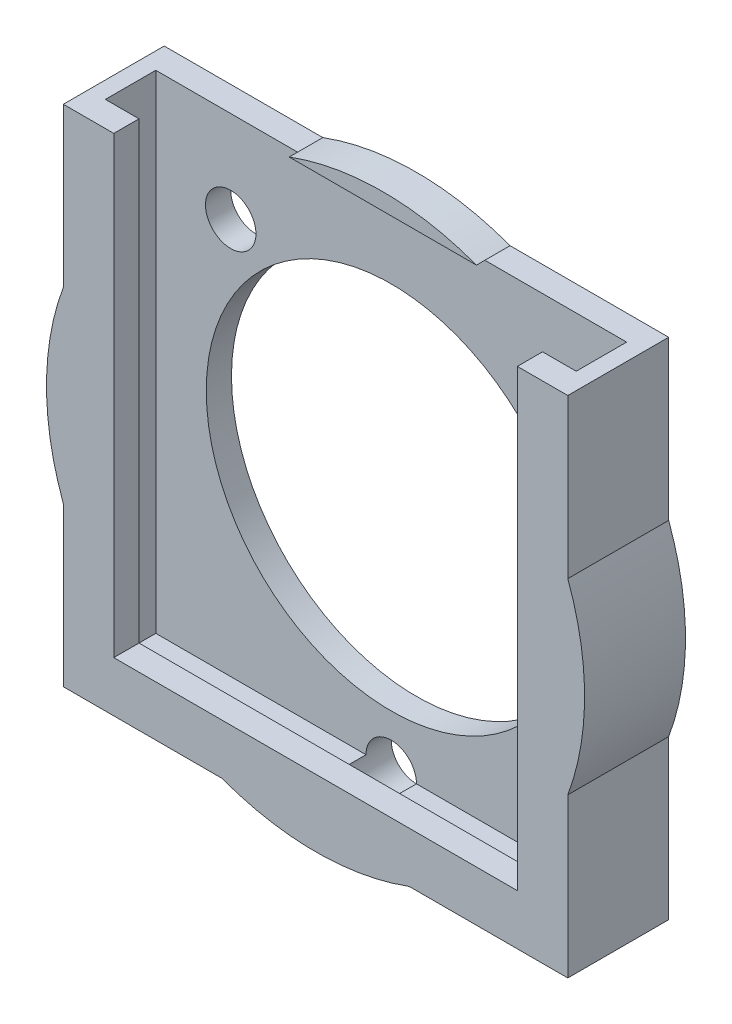
ISO-10303-21;
HEADER;
FILE_DESCRIPTION(('STEP AP214'),'2;1');
FILE_NAME('part.step','',(''),(''),'','','');
FILE_SCHEMA(('AUTOMOTIVE_DESIGN { 1 0 10303 214 1 1 1 1 }'));
ENDSEC;
DATA;
#1=APPLICATION_CONTEXT('core data for automotive mechanical design processes');
#2=APPLICATION_PROTOCOL_DEFINITION('international standard','automotive_design',2000,#1);
#3=PRODUCT_CONTEXT('',#1,'mechanical');
#4=PRODUCT('Part','Part','',(#3));
#5=PRODUCT_RELATED_PRODUCT_CATEGORY('part','',(#4));
#6=PRODUCT_DEFINITION_FORMATION('','',#4);
#7=PRODUCT_DEFINITION_CONTEXT('part definition',#1,'design');
#8=PRODUCT_DEFINITION('design','',#6,#7);
#9=PRODUCT_DEFINITION_SHAPE('','',#8);
#10=(LENGTH_UNIT() NAMED_UNIT(*) SI_UNIT(.MILLI.,.METRE.));
#11=(NAMED_UNIT(*) PLANE_ANGLE_UNIT() SI_UNIT($,.RADIAN.));
#12=(NAMED_UNIT(*) SI_UNIT($,.STERADIAN.) SOLID_ANGLE_UNIT());
#13=UNCERTAINTY_MEASURE_WITH_UNIT(LENGTH_MEASURE(1.E-05),#10,'distance_accuracy_value','');
#14=(GEOMETRIC_REPRESENTATION_CONTEXT(3) GLOBAL_UNCERTAINTY_ASSIGNED_CONTEXT((#13)) GLOBAL_UNIT_ASSIGNED_CONTEXT((#10,
#11,#12)) REPRESENTATION_CONTEXT('',''));
#15=CARTESIAN_POINT('',(0.,0.,0.));
#16=DIRECTION('',(0.,0.,1.));
#17=DIRECTION('',(1.,0.,0.));
#18=AXIS2_PLACEMENT_3D('',#15,#16,#17);
#19=CARTESIAN_POINT('',(0.,15.,6.));
#20=DIRECTION('',(0.,1.,0.));
#21=DIRECTION('',(-1.,0.,0.));
#22=AXIS2_PLACEMENT_3D('',#19,#20,#21);
#23=PLANE('',#22);
#24=DIRECTION('',(0.,0.,-1.));
#25=VECTOR('',#24,1.);
#26=CARTESIAN_POINT('',(5.56776436283004,15.,6.));
#27=LINE('',#26,#25);
#28=CARTESIAN_POINT('',(5.56776436283004,15.,1.5));
#29=VERTEX_POINT('',#28);
#30=CARTESIAN_POINT('',(5.56776436283004,15.,0.));
#31=VERTEX_POINT('',#30);
#32=EDGE_CURVE('E421',#29,#31,#27,.T.);
#33=ORIENTED_EDGE('',*,*,#32,.F.);
#34=DIRECTION('',(1.,0.,0.));
#35=VECTOR('',#34,1.);
#36=CARTESIAN_POINT('',(0.,15.,1.5));
#37=LINE('',#36,#35);
#38=CARTESIAN_POINT('',(14.,15.,1.5));
#39=VERTEX_POINT('',#38);
#40=EDGE_CURVE('E309',#29,#39,#37,.T.);
#41=ORIENTED_EDGE('',*,*,#40,.T.);
#42=DIRECTION('',(0.,0.,-1.));
#43=VECTOR('',#42,1.);
#44=CARTESIAN_POINT('',(14.,15.,4.));
#45=LINE('',#44,#43);
#46=CARTESIAN_POINT('',(14.,15.,4.5));
#47=VERTEX_POINT('',#46);
#48=EDGE_CURVE('E335',#47,#39,#45,.T.);
#49=ORIENTED_EDGE('',*,*,#48,.F.);
#50=DIRECTION('',(1.,0.,0.));
#51=VECTOR('',#50,1.);
#52=CARTESIAN_POINT('',(0.,15.,4.5));
#53=LINE('',#52,#51);
#54=CARTESIAN_POINT('',(12.,15.,4.5));
#55=VERTEX_POINT('',#54);
#56=EDGE_CURVE('E310',#55,#47,#53,.T.);
#57=ORIENTED_EDGE('',*,*,#56,.F.);
#58=DIRECTION('',(0.,0.,1.));
#59=VECTOR('',#58,1.);
#60=CARTESIAN_POINT('',(12.,15.,2.));
#61=LINE('',#60,#59);
#62=CARTESIAN_POINT('',(12.,15.,6.));
#63=VERTEX_POINT('',#62);
#64=EDGE_CURVE('E344',#55,#63,#61,.T.);
#65=ORIENTED_EDGE('',*,*,#64,.T.);
#66=DIRECTION('',(1.,0.,0.));
#67=VECTOR('',#66,1.);
#68=CARTESIAN_POINT('',(0.,15.,6.));
#69=LINE('',#68,#67);
#70=CARTESIAN_POINT('',(15.,15.,6.));
#71=VERTEX_POINT('',#70);
#72=EDGE_CURVE('E379',#63,#71,#69,.T.);
#73=ORIENTED_EDGE('',*,*,#72,.T.);
#74=DIRECTION('',(0.,0.,-1.));
#75=VECTOR('',#74,1.);
#76=CARTESIAN_POINT('',(15.,15.,6.));
#77=LINE('',#76,#75);
#78=CARTESIAN_POINT('',(15.,15.,0.));
#79=VERTEX_POINT('',#78);
#80=EDGE_CURVE('E423',#71,#79,#77,.T.);
#81=ORIENTED_EDGE('',*,*,#80,.T.);
#82=DIRECTION('',(1.,0.,0.));
#83=VECTOR('',#82,1.);
#84=CARTESIAN_POINT('',(0.,15.,0.));
#85=LINE('',#84,#83);
#86=EDGE_CURVE('E403',#31,#79,#85,.T.);
#87=ORIENTED_EDGE('',*,*,#86,.F.);
#88=EDGE_LOOP('',(#33,#41,#49,#57,#65,#73,#81,#87));
#89=FACE_BOUND('',#88,.T.);
#90=ADVANCED_FACE('F119',(#89),#23,.T.);
#91=CARTESIAN_POINT('',(0.,15.,6.));
#92=DIRECTION('',(0.,1.,0.));
#93=DIRECTION('',(-1.,0.,0.));
#94=AXIS2_PLACEMENT_3D('',#91,#92,#93);
#95=PLANE('',#94);
#96=DIRECTION('',(0.,0.,1.));
#97=VECTOR('',#96,1.);
#98=CARTESIAN_POINT('',(-14.,15.,2.));
#99=LINE('',#98,#97);
#100=CARTESIAN_POINT('',(-14.,15.,1.5));
#101=VERTEX_POINT('',#100);
#102=CARTESIAN_POINT('',(-14.,15.,4.5));
#103=VERTEX_POINT('',#102);
#104=EDGE_CURVE('E338',#101,#103,#99,.T.);
#105=ORIENTED_EDGE('',*,*,#104,.F.);
#106=CARTESIAN_POINT('',(-5.56776436283004,15.,1.5));
#107=VERTEX_POINT('',#106);
#108=EDGE_CURVE('E303',#101,#107,#37,.T.);
#109=ORIENTED_EDGE('',*,*,#108,.T.);
#110=DIRECTION('',(0.,0.,-1.));
#111=VECTOR('',#110,1.);
#112=CARTESIAN_POINT('',(-5.56776436283004,15.,6.));
#113=LINE('',#112,#111);
#114=CARTESIAN_POINT('',(-5.56776436283004,15.,0.));
#115=VERTEX_POINT('',#114);
#116=EDGE_CURVE('E418',#107,#115,#113,.T.);
#117=ORIENTED_EDGE('',*,*,#116,.T.);
#118=DIRECTION('',(1.,0.,0.));
#119=VECTOR('',#118,1.);
#120=CARTESIAN_POINT('',(0.,15.,0.));
#121=LINE('',#120,#119);
#122=CARTESIAN_POINT('',(-15.,15.,0.));
#123=VERTEX_POINT('',#122);
#124=EDGE_CURVE('E409',#123,#115,#121,.T.);
#125=ORIENTED_EDGE('',*,*,#124,.F.);
#126=DIRECTION('',(0.,0.,-1.));
#127=VECTOR('',#126,1.);
#128=CARTESIAN_POINT('',(-15.,15.,6.));
#129=LINE('',#128,#127);
#130=CARTESIAN_POINT('',(-15.,15.,6.));
#131=VERTEX_POINT('',#130);
#132=EDGE_CURVE('E416',#131,#123,#129,.T.);
#133=ORIENTED_EDGE('',*,*,#132,.F.);
#134=DIRECTION('',(1.,0.,0.));
#135=VECTOR('',#134,1.);
#136=CARTESIAN_POINT('',(0.,15.,6.));
#137=LINE('',#136,#135);
#138=CARTESIAN_POINT('',(-12.,15.,6.));
#139=VERTEX_POINT('',#138);
#140=EDGE_CURVE('E381',#131,#139,#137,.T.);
#141=ORIENTED_EDGE('',*,*,#140,.T.);
#142=DIRECTION('',(0.,0.,1.));
#143=VECTOR('',#142,1.);
#144=CARTESIAN_POINT('',(-12.,15.,2.));
#145=LINE('',#144,#143);
#146=CARTESIAN_POINT('',(-12.,15.,4.5));
#147=VERTEX_POINT('',#146);
#148=EDGE_CURVE('E358',#147,#139,#145,.T.);
#149=ORIENTED_EDGE('',*,*,#148,.F.);
#150=EDGE_CURVE('E307',#103,#147,#53,.T.);
#151=ORIENTED_EDGE('',*,*,#150,.F.);
#152=EDGE_LOOP('',(#105,#109,#117,#125,#133,#141,#149,#151));
#153=FACE_BOUND('',#152,.T.);
#154=ADVANCED_FACE('F476',(#153),#95,.T.);
#155=CARTESIAN_POINT('',(0.,0.,-4.));
#156=DIRECTION('',(0.,0.,1.));
#157=DIRECTION('',(1.,0.,0.));
#158=AXIS2_PLACEMENT_3D('',#155,#156,#157);
#159=CYLINDRICAL_SURFACE('',#158,11.);
#160=CARTESIAN_POINT('',(0.,0.,0.));
#161=DIRECTION('',(0.,0.,1.));
#162=DIRECTION('',(1.,0.,0.));
#163=AXIS2_PLACEMENT_3D('',#160,#161,#162);
#164=CIRCLE('',#163,11.);
#165=CARTESIAN_POINT('',(11.,0.,0.));
#166=VERTEX_POINT('',#165);
#167=EDGE_CURVE('E355',#166,#166,#164,.T.);
#168=ORIENTED_EDGE('',*,*,#167,.F.);
#169=EDGE_LOOP('',(#168));
#170=FACE_BOUND('',#169,.T.);
#171=CARTESIAN_POINT('',(0.,0.,1.5));
#172=DIRECTION('',(0.,0.,1.));
#173=DIRECTION('',(1.,0.,0.));
#174=AXIS2_PLACEMENT_3D('',#171,#172,#173);
#175=CIRCLE('',#174,11.);
#176=CARTESIAN_POINT('',(11.,0.,1.5));
#177=VERTEX_POINT('',#176);
#178=EDGE_CURVE('E331',#177,#177,#175,.F.);
#179=ORIENTED_EDGE('',*,*,#178,.F.);
#180=EDGE_LOOP('',(#179));
#181=FACE_BOUND('',#180,.T.);
#182=ADVANCED_FACE('F571',(#170,#181),#159,.F.);
#183=CARTESIAN_POINT('',(0.,0.,6.));
#184=DIRECTION('',(0.,0.,1.));
#185=DIRECTION('',(1.,0.,0.));
#186=AXIS2_PLACEMENT_3D('',#183,#184,#185);
#187=PLANE('',#186);
#188=ORIENTED_EDGE('',*,*,#72,.F.);
#189=DIRECTION('',(0.,-1.,0.));
#190=VECTOR('',#189,1.);
#191=CARTESIAN_POINT('',(12.,0.,6.));
#192=LINE('',#191,#190);
#193=CARTESIAN_POINT('',(12.,-12.,6.));
#194=VERTEX_POINT('',#193);
#195=EDGE_CURVE('E337',#63,#194,#192,.T.);
#196=ORIENTED_EDGE('',*,*,#195,.T.);
#197=DIRECTION('',(-1.,0.,0.));
#198=VECTOR('',#197,1.);
#199=CARTESIAN_POINT('',(0.,-12.,6.));
#200=LINE('',#199,#198);
#201=CARTESIAN_POINT('',(-12.,-12.,6.));
#202=VERTEX_POINT('',#201);
#203=EDGE_CURVE('E345',#194,#202,#200,.T.);
#204=ORIENTED_EDGE('',*,*,#203,.T.);
#205=DIRECTION('',(0.,1.,0.));
#206=VECTOR('',#205,1.);
#207=CARTESIAN_POINT('',(-12.,0.,6.));
#208=LINE('',#207,#206);
#209=EDGE_CURVE('E348',#202,#139,#208,.T.);
#210=ORIENTED_EDGE('',*,*,#209,.T.);
#211=ORIENTED_EDGE('',*,*,#140,.F.);
#212=DIRECTION('',(0.,1.,0.));
#213=VECTOR('',#212,1.);
#214=CARTESIAN_POINT('',(-15.,0.,6.));
#215=LINE('',#214,#213);
#216=CARTESIAN_POINT('',(-15.,5.56776436283003,6.));
#217=VERTEX_POINT('',#216);
#218=EDGE_CURVE('E384',#217,#131,#215,.T.);
#219=ORIENTED_EDGE('',*,*,#218,.F.);
#220=CARTESIAN_POINT('',(0.,0.,6.));
#221=DIRECTION('',(0.,0.,1.));
#222=DIRECTION('',(1.,0.,0.));
#223=AXIS2_PLACEMENT_3D('',#220,#221,#222);
#224=CIRCLE('',#223,16.);
#225=CARTESIAN_POINT('',(-15.,-5.56776436283004,6.));
#226=VERTEX_POINT('',#225);
#227=EDGE_CURVE('E364',#217,#226,#224,.T.);
#228=ORIENTED_EDGE('',*,*,#227,.T.);
#229=DIRECTION('',(0.,1.,0.));
#230=VECTOR('',#229,1.);
#231=CARTESIAN_POINT('',(-15.,-15.,6.));
#232=LINE('',#231,#230);
#233=CARTESIAN_POINT('',(-15.,-15.,6.));
#234=VERTEX_POINT('',#233);
#235=EDGE_CURVE('E438',#234,#226,#232,.T.);
#236=ORIENTED_EDGE('',*,*,#235,.F.);
#237=DIRECTION('',(1.,0.,0.));
#238=VECTOR('',#237,1.);
#239=CARTESIAN_POINT('',(-15.,-15.,6.));
#240=LINE('',#239,#238);
#241=CARTESIAN_POINT('',(-5.56776436283,-15.,6.));
#242=VERTEX_POINT('',#241);
#243=EDGE_CURVE('E435',#234,#242,#240,.T.);
#244=ORIENTED_EDGE('',*,*,#243,.T.);
#245=CARTESIAN_POINT('',(5.56776436283,-15.,6.));
#246=VERTEX_POINT('',#245);
#247=EDGE_CURVE('E368',#242,#246,#224,.T.);
#248=ORIENTED_EDGE('',*,*,#247,.T.);
#249=DIRECTION('',(1.,0.,0.));
#250=VECTOR('',#249,1.);
#251=CARTESIAN_POINT('',(0.,-15.,6.));
#252=LINE('',#251,#250);
#253=CARTESIAN_POINT('',(15.,-15.,6.));
#254=VERTEX_POINT('',#253);
#255=EDGE_CURVE('E367',#246,#254,#252,.T.);
#256=ORIENTED_EDGE('',*,*,#255,.T.);
#257=DIRECTION('',(0.,1.,0.));
#258=VECTOR('',#257,1.);
#259=CARTESIAN_POINT('',(15.,0.,6.));
#260=LINE('',#259,#258);
#261=CARTESIAN_POINT('',(15.,-5.56776436283002,6.));
#262=VERTEX_POINT('',#261);
#263=EDGE_CURVE('E370',#254,#262,#260,.T.);
#264=ORIENTED_EDGE('',*,*,#263,.T.);
#265=CARTESIAN_POINT('',(0.,0.,6.));
#266=DIRECTION('',(0.,0.,1.));
#267=DIRECTION('',(1.,0.,0.));
#268=AXIS2_PLACEMENT_3D('',#265,#266,#267);
#269=CIRCLE('',#268,16.);
#270=CARTESIAN_POINT('',(15.,5.56776436283001,6.));
#271=VERTEX_POINT('',#270);
#272=EDGE_CURVE('E373',#262,#271,#269,.T.);
#273=ORIENTED_EDGE('',*,*,#272,.T.);
#274=DIRECTION('',(0.,1.,0.));
#275=VECTOR('',#274,1.);
#276=CARTESIAN_POINT('',(15.,0.,6.));
#277=LINE('',#276,#275);
#278=EDGE_CURVE('E376',#271,#71,#277,.T.);
#279=ORIENTED_EDGE('',*,*,#278,.T.);
#280=EDGE_LOOP('',(#188,#196,#204,#210,#211,#219,#228,#236,#244,#248,#256,#264,#273,#279));
#281=FACE_BOUND('',#280,.T.);
#282=ADVANCED_FACE('F485',(#281),#187,.T.);
#283=CARTESIAN_POINT('',(0.,0.,6.));
#284=DIRECTION('',(0.,0.,-1.));
#285=DIRECTION('',(-1.,0.,0.));
#286=AXIS2_PLACEMENT_3D('',#283,#284,#285);
#287=CYLINDRICAL_SURFACE('',#286,16.);
#288=CARTESIAN_POINT('',(0.,0.,2.));
#289=DIRECTION('',(0.,0.,1.));
#290=DIRECTION('',(1.,0.,0.));
#291=AXIS2_PLACEMENT_3D('',#288,#289,#290);
#292=CIRCLE('',#291,16.);
#293=CARTESIAN_POINT('',(5.56776436283004,15.,2.));
#294=VERTEX_POINT('',#293);
#295=CARTESIAN_POINT('',(-5.56776436283004,15.,2.));
#296=VERTEX_POINT('',#295);
#297=EDGE_CURVE('E341',#294,#296,#292,.T.);
#298=ORIENTED_EDGE('',*,*,#297,.F.);
#299=EDGE_CURVE('E142',#294,#29,#27,.T.);
#300=ORIENTED_EDGE('',*,*,#299,.T.);
#301=ORIENTED_EDGE('',*,*,#32,.T.);
#302=CARTESIAN_POINT('',(0.,0.,0.));
#303=DIRECTION('',(0.,0.,1.));
#304=DIRECTION('',(1.,0.,0.));
#305=AXIS2_PLACEMENT_3D('',#302,#303,#304);
#306=CIRCLE('',#305,16.);
#307=EDGE_CURVE('E406',#31,#115,#306,.T.);
#308=ORIENTED_EDGE('',*,*,#307,.T.);
#309=ORIENTED_EDGE('',*,*,#116,.F.);
#310=EDGE_CURVE('E419',#296,#107,#113,.T.);
#311=ORIENTED_EDGE('',*,*,#310,.F.);
#312=EDGE_LOOP('',(#298,#300,#301,#308,#309,#311));
#313=FACE_BOUND('',#312,.T.);
#314=ADVANCED_FACE('F511',(#313),#287,.T.);
#315=CARTESIAN_POINT('',(0.,-15.,6.));
#316=DIRECTION('',(0.,1.,0.));
#317=DIRECTION('',(-1.,0.,0.));
#318=AXIS2_PLACEMENT_3D('',#315,#316,#317);
#319=PLANE('',#318);
#320=DIRECTION('',(1.,0.,0.));
#321=VECTOR('',#320,1.);
#322=CARTESIAN_POINT('',(0.,-15.,0.));
#323=LINE('',#322,#321);
#324=CARTESIAN_POINT('',(5.56776436283,-15.,0.));
#325=VERTEX_POINT('',#324);
#326=CARTESIAN_POINT('',(15.,-15.,0.));
#327=VERTEX_POINT('',#326);
#328=EDGE_CURVE('E391',#325,#327,#323,.T.);
#329=ORIENTED_EDGE('',*,*,#328,.T.);
#330=DIRECTION('',(0.,0.,-1.));
#331=VECTOR('',#330,1.);
#332=CARTESIAN_POINT('',(15.,-15.,6.));
#333=LINE('',#332,#331);
#334=EDGE_CURVE('E429',#254,#327,#333,.T.);
#335=ORIENTED_EDGE('',*,*,#334,.F.);
#336=ORIENTED_EDGE('',*,*,#255,.F.);
#337=DIRECTION('',(0.,0.,-1.));
#338=VECTOR('',#337,1.);
#339=CARTESIAN_POINT('',(5.56776436283,-15.,6.));
#340=LINE('',#339,#338);
#341=EDGE_CURVE('E432',#246,#325,#340,.T.);
#342=ORIENTED_EDGE('',*,*,#341,.T.);
#343=EDGE_LOOP('',(#329,#335,#336,#342));
#344=FACE_BOUND('',#343,.T.);
#345=ADVANCED_FACE('F545',(#344),#319,.F.);
#346=CARTESIAN_POINT('',(15.,0.,6.));
#347=DIRECTION('',(-1.,0.,0.));
#348=DIRECTION('',(0.,-1.,0.));
#349=AXIS2_PLACEMENT_3D('',#346,#347,#348);
#350=PLANE('',#349);
#351=DIRECTION('',(0.,1.,0.));
#352=VECTOR('',#351,1.);
#353=CARTESIAN_POINT('',(15.,0.,0.));
#354=LINE('',#353,#352);
#355=CARTESIAN_POINT('',(15.,5.56776436283001,0.));
#356=VERTEX_POINT('',#355);
#357=EDGE_CURVE('E400',#356,#79,#354,.T.);
#358=ORIENTED_EDGE('',*,*,#357,.T.);
#359=ORIENTED_EDGE('',*,*,#80,.F.);
#360=ORIENTED_EDGE('',*,*,#278,.F.);
#361=DIRECTION('',(0.,0.,-1.));
#362=VECTOR('',#361,1.);
#363=CARTESIAN_POINT('',(15.,5.56776436283001,6.));
#364=LINE('',#363,#362);
#365=EDGE_CURVE('E425',#271,#356,#364,.T.);
#366=ORIENTED_EDGE('',*,*,#365,.T.);
#367=EDGE_LOOP('',(#358,#359,#360,#366));
#368=FACE_BOUND('',#367,.T.);
#369=ADVANCED_FACE('F501',(#368),#350,.F.);
#370=CARTESIAN_POINT('',(15.,0.,6.));
#371=DIRECTION('',(-1.,0.,0.));
#372=DIRECTION('',(0.,-1.,0.));
#373=AXIS2_PLACEMENT_3D('',#370,#371,#372);
#374=PLANE('',#373);
#375=DIRECTION('',(0.,1.,0.));
#376=VECTOR('',#375,1.);
#377=CARTESIAN_POINT('',(15.,0.,0.));
#378=LINE('',#377,#376);
#379=CARTESIAN_POINT('',(15.,-5.56776436283002,0.));
#380=VERTEX_POINT('',#379);
#381=EDGE_CURVE('E394',#327,#380,#378,.T.);
#382=ORIENTED_EDGE('',*,*,#381,.T.);
#383=DIRECTION('',(0.,0.,-1.));
#384=VECTOR('',#383,1.);
#385=CARTESIAN_POINT('',(15.,-5.56776436283002,6.));
#386=LINE('',#385,#384);
#387=EDGE_CURVE('E427',#262,#380,#386,.T.);
#388=ORIENTED_EDGE('',*,*,#387,.F.);
#389=ORIENTED_EDGE('',*,*,#263,.F.);
#390=ORIENTED_EDGE('',*,*,#334,.T.);
#391=EDGE_LOOP('',(#382,#388,#389,#390));
#392=FACE_BOUND('',#391,.T.);
#393=ADVANCED_FACE('F552',(#392),#374,.F.);
#394=CARTESIAN_POINT('',(-15.,0.,6.));
#395=DIRECTION('',(-1.,0.,0.));
#396=DIRECTION('',(0.,0.,1.));
#397=AXIS2_PLACEMENT_3D('',#394,#395,#396);
#398=PLANE('',#397);
#399=DIRECTION('',(0.,1.,0.));
#400=VECTOR('',#399,1.);
#401=CARTESIAN_POINT('',(-15.,0.,0.));
#402=LINE('',#401,#400);
#403=CARTESIAN_POINT('',(-15.,5.56776436283003,0.));
#404=VERTEX_POINT('',#403);
#405=EDGE_CURVE('E412',#404,#123,#402,.T.);
#406=ORIENTED_EDGE('',*,*,#405,.F.);
#407=DIRECTION('',(0.,0.,-1.));
#408=VECTOR('',#407,1.);
#409=CARTESIAN_POINT('',(-15.,5.56776436283003,6.));
#410=LINE('',#409,#408);
#411=EDGE_CURVE('E387',#217,#404,#410,.T.);
#412=ORIENTED_EDGE('',*,*,#411,.F.);
#413=ORIENTED_EDGE('',*,*,#218,.T.);
#414=ORIENTED_EDGE('',*,*,#132,.T.);
#415=EDGE_LOOP('',(#406,#412,#413,#414));
#416=FACE_BOUND('',#415,.T.);
#417=ADVANCED_FACE('F526',(#416),#398,.T.);
#418=CARTESIAN_POINT('',(0.,0.,6.));
#419=DIRECTION('',(0.,0.,-1.));
#420=DIRECTION('',(-1.,0.,0.));
#421=AXIS2_PLACEMENT_3D('',#418,#419,#420);
#422=CYLINDRICAL_SURFACE('',#421,16.);
#423=DIRECTION('',(0.,0.,-1.));
#424=VECTOR('',#423,1.);
#425=CARTESIAN_POINT('',(-5.56776436283,-15.,6.));
#426=LINE('',#425,#424);
#427=CARTESIAN_POINT('',(-5.56776436283,-15.,0.));
#428=VERTEX_POINT('',#427);
#429=EDGE_CURVE('E434',#428,#242,#426,.F.);
#430=ORIENTED_EDGE('',*,*,#429,.F.);
#431=CARTESIAN_POINT('',(0.,0.,0.));
#432=DIRECTION('',(0.,0.,1.));
#433=DIRECTION('',(1.,0.,0.));
#434=AXIS2_PLACEMENT_3D('',#431,#432,#433);
#435=CIRCLE('',#434,16.);
#436=EDGE_CURVE('E392',#428,#325,#435,.T.);
#437=ORIENTED_EDGE('',*,*,#436,.T.);
#438=ORIENTED_EDGE('',*,*,#341,.F.);
#439=ORIENTED_EDGE('',*,*,#247,.F.);
#440=EDGE_LOOP('',(#430,#437,#438,#439));
#441=FACE_BOUND('',#440,.T.);
#442=ADVANCED_FACE('F541',(#441),#422,.T.);
#443=CARTESIAN_POINT('',(0.,0.,6.));
#444=DIRECTION('',(0.,0.,-1.));
#445=DIRECTION('',(-1.,0.,0.));
#446=AXIS2_PLACEMENT_3D('',#443,#444,#445);
#447=CYLINDRICAL_SURFACE('',#446,16.);
#448=CARTESIAN_POINT('',(0.,0.,0.));
#449=DIRECTION('',(0.,0.,1.));
#450=DIRECTION('',(1.,0.,0.));
#451=AXIS2_PLACEMENT_3D('',#448,#449,#450);
#452=CIRCLE('',#451,16.);
#453=EDGE_CURVE('E397',#380,#356,#452,.T.);
#454=ORIENTED_EDGE('',*,*,#453,.T.);
#455=ORIENTED_EDGE('',*,*,#365,.F.);
#456=ORIENTED_EDGE('',*,*,#272,.F.);
#457=ORIENTED_EDGE('',*,*,#387,.T.);
#458=EDGE_LOOP('',(#454,#455,#456,#457));
#459=FACE_BOUND('',#458,.T.);
#460=ADVANCED_FACE('F550',(#459),#447,.T.);
#461=CARTESIAN_POINT('',(0.,0.,0.));
#462=DIRECTION('',(0.,0.,1.));
#463=DIRECTION('',(1.,0.,0.));
#464=AXIS2_PLACEMENT_3D('',#461,#462,#463);
#465=PLANE('',#464);
#466=CARTESIAN_POINT('',(9.54594154601839,9.54594154601839,0.));
#467=DIRECTION('',(0.,0.,-1.));
#468=DIRECTION('',(-1.,0.,0.));
#469=AXIS2_PLACEMENT_3D('',#466,#467,#468);
#470=CIRCLE('',#469,1.5);
#471=CARTESIAN_POINT('',(8.04594154601839,9.54594154601839,0.));
#472=VERTEX_POINT('',#471);
#473=EDGE_CURVE('E282',#472,#472,#470,.T.);
#474=ORIENTED_EDGE('',*,*,#473,.F.);
#475=EDGE_LOOP('',(#474));
#476=FACE_BOUND('',#475,.T.);
#477=CARTESIAN_POINT('',(-9.54594154601839,9.54594154601839,0.));
#478=DIRECTION('',(0.,0.,-1.));
#479=DIRECTION('',(-1.,0.,0.));
#480=AXIS2_PLACEMENT_3D('',#477,#478,#479);
#481=CIRCLE('',#480,1.5);
#482=CARTESIAN_POINT('',(-11.0459415460184,9.54594154601839,0.));
#483=VERTEX_POINT('',#482);
#484=EDGE_CURVE('E286',#483,#483,#481,.T.);
#485=ORIENTED_EDGE('',*,*,#484,.F.);
#486=EDGE_LOOP('',(#485));
#487=FACE_BOUND('',#486,.T.);
#488=CARTESIAN_POINT('',(0.,-14.,0.));
#489=DIRECTION('',(0.,0.,-1.));
#490=DIRECTION('',(-1.,0.,0.));
#491=AXIS2_PLACEMENT_3D('',#488,#489,#490);
#492=CIRCLE('',#491,1.5);
#493=CARTESIAN_POINT('',(-1.5,-14.,0.));
#494=VERTEX_POINT('',#493);
#495=EDGE_CURVE('E287',#494,#494,#492,.T.);
#496=ORIENTED_EDGE('',*,*,#495,.F.);
#497=EDGE_LOOP('',(#496));
#498=FACE_BOUND('',#497,.T.);
#499=ORIENTED_EDGE('',*,*,#167,.T.);
#500=EDGE_LOOP('',(#499));
#501=FACE_BOUND('',#500,.T.);
#502=ORIENTED_EDGE('',*,*,#328,.F.);
#503=ORIENTED_EDGE('',*,*,#436,.F.);
#504=DIRECTION('',(1.,0.,0.));
#505=VECTOR('',#504,1.);
#506=CARTESIAN_POINT('',(-15.,-15.,0.));
#507=LINE('',#506,#505);
#508=CARTESIAN_POINT('',(-15.,-15.,0.));
#509=VERTEX_POINT('',#508);
#510=EDGE_CURVE('E363',#509,#428,#507,.T.);
#511=ORIENTED_EDGE('',*,*,#510,.F.);
#512=DIRECTION('',(0.,1.,0.));
#513=VECTOR('',#512,1.);
#514=CARTESIAN_POINT('',(-15.,-15.,0.));
#515=LINE('',#514,#513);
#516=CARTESIAN_POINT('',(-15.,-5.56776436283004,0.));
#517=VERTEX_POINT('',#516);
#518=EDGE_CURVE('E439',#509,#517,#515,.T.);
#519=ORIENTED_EDGE('',*,*,#518,.T.);
#520=EDGE_CURVE('E388',#404,#517,#435,.T.);
#521=ORIENTED_EDGE('',*,*,#520,.F.);
#522=ORIENTED_EDGE('',*,*,#405,.T.);
#523=ORIENTED_EDGE('',*,*,#124,.T.);
#524=ORIENTED_EDGE('',*,*,#307,.F.);
#525=ORIENTED_EDGE('',*,*,#86,.T.);
#526=ORIENTED_EDGE('',*,*,#357,.F.);
#527=ORIENTED_EDGE('',*,*,#453,.F.);
#528=ORIENTED_EDGE('',*,*,#381,.F.);
#529=EDGE_LOOP('',(#502,#503,#511,#519,#521,#522,#523,#524,#525,#526,#527,#528));
#530=FACE_BOUND('',#529,.T.);
#531=ADVANCED_FACE('F507',(#476,#487,#498,#501,#530),#465,.F.);
#532=ORIENTED_EDGE('',*,*,#520,.T.);
#533=DIRECTION('',(0.,0.,-1.));
#534=VECTOR('',#533,1.);
#535=CARTESIAN_POINT('',(-15.,-5.56776436283003,6.));
#536=LINE('',#535,#534);
#537=EDGE_CURVE('E449',#517,#226,#536,.F.);
#538=ORIENTED_EDGE('',*,*,#537,.T.);
#539=ORIENTED_EDGE('',*,*,#227,.F.);
#540=ORIENTED_EDGE('',*,*,#411,.T.);
#541=EDGE_LOOP('',(#532,#538,#539,#540));
#542=FACE_BOUND('',#541,.T.);
#543=ADVANCED_FACE('F530',(#542),#422,.T.);
#544=CARTESIAN_POINT('',(-15.,-15.,6.));
#545=DIRECTION('',(0.,1.,0.));
#546=DIRECTION('',(-1.,0.,0.));
#547=AXIS2_PLACEMENT_3D('',#544,#545,#546);
#548=PLANE('',#547);
#549=ORIENTED_EDGE('',*,*,#510,.T.);
#550=ORIENTED_EDGE('',*,*,#429,.T.);
#551=ORIENTED_EDGE('',*,*,#243,.F.);
#552=DIRECTION('',(0.,0.,-1.));
#553=VECTOR('',#552,1.);
#554=CARTESIAN_POINT('',(-15.,-15.,6.));
#555=LINE('',#554,#553);
#556=EDGE_CURVE('E442',#234,#509,#555,.T.);
#557=ORIENTED_EDGE('',*,*,#556,.T.);
#558=EDGE_LOOP('',(#549,#550,#551,#557));
#559=FACE_BOUND('',#558,.T.);
#560=ADVANCED_FACE('F121',(#559),#548,.F.);
#561=CARTESIAN_POINT('',(-15.,-15.,6.));
#562=DIRECTION('',(-1.,0.,0.));
#563=DIRECTION('',(0.,0.,1.));
#564=AXIS2_PLACEMENT_3D('',#561,#562,#563);
#565=PLANE('',#564);
#566=ORIENTED_EDGE('',*,*,#537,.F.);
#567=ORIENTED_EDGE('',*,*,#518,.F.);
#568=ORIENTED_EDGE('',*,*,#556,.F.);
#569=ORIENTED_EDGE('',*,*,#235,.T.);
#570=EDGE_LOOP('',(#566,#567,#568,#569));
#571=FACE_BOUND('',#570,.T.);
#572=ADVANCED_FACE('F533',(#571),#565,.T.);
#573=CARTESIAN_POINT('',(12.,0.,2.));
#574=DIRECTION('',(-1.,0.,0.));
#575=DIRECTION('',(0.,-1.,0.));
#576=AXIS2_PLACEMENT_3D('',#573,#574,#575);
#577=PLANE('',#576);
#578=DIRECTION('',(0.,1.,0.));
#579=VECTOR('',#578,1.);
#580=CARTESIAN_POINT('',(12.,0.,4.5));
#581=LINE('',#580,#579);
#582=CARTESIAN_POINT('',(12.,-12.,4.5));
#583=VERTEX_POINT('',#582);
#584=EDGE_CURVE('E329',#583,#55,#581,.T.);
#585=ORIENTED_EDGE('',*,*,#584,.F.);
#586=DIRECTION('',(0.,0.,1.));
#587=VECTOR('',#586,1.);
#588=CARTESIAN_POINT('',(12.,-12.,2.));
#589=LINE('',#588,#587);
#590=EDGE_CURVE('E353',#583,#194,#589,.T.);
#591=ORIENTED_EDGE('',*,*,#590,.T.);
#592=ORIENTED_EDGE('',*,*,#195,.F.);
#593=ORIENTED_EDGE('',*,*,#64,.F.);
#594=EDGE_LOOP('',(#585,#591,#592,#593));
#595=FACE_BOUND('',#594,.T.);
#596=ADVANCED_FACE('F494',(#595),#577,.T.);
#597=CARTESIAN_POINT('',(0.,-12.,2.));
#598=DIRECTION('',(0.,1.,0.));
#599=DIRECTION('',(-1.,0.,0.));
#600=AXIS2_PLACEMENT_3D('',#597,#598,#599);
#601=PLANE('',#600);
#602=DIRECTION('',(1.,0.,0.));
#603=VECTOR('',#602,1.);
#604=CARTESIAN_POINT('',(0.,-12.,4.5));
#605=LINE('',#604,#603);
#606=CARTESIAN_POINT('',(-12.,-12.,4.5));
#607=VERTEX_POINT('',#606);
#608=EDGE_CURVE('E327',#607,#583,#605,.T.);
#609=ORIENTED_EDGE('',*,*,#608,.F.);
#610=DIRECTION('',(0.,0.,1.));
#611=VECTOR('',#610,1.);
#612=CARTESIAN_POINT('',(-12.,-12.,2.));
#613=LINE('',#612,#611);
#614=EDGE_CURVE('E356',#607,#202,#613,.T.);
#615=ORIENTED_EDGE('',*,*,#614,.T.);
#616=ORIENTED_EDGE('',*,*,#203,.F.);
#617=ORIENTED_EDGE('',*,*,#590,.F.);
#618=EDGE_LOOP('',(#609,#615,#616,#617));
#619=FACE_BOUND('',#618,.T.);
#620=ADVANCED_FACE('F492',(#619),#601,.T.);
#621=CARTESIAN_POINT('',(-12.,0.,2.));
#622=DIRECTION('',(1.,0.,0.));
#623=DIRECTION('',(0.,0.,-1.));
#624=AXIS2_PLACEMENT_3D('',#621,#622,#623);
#625=PLANE('',#624);
#626=DIRECTION('',(0.,-1.,0.));
#627=VECTOR('',#626,1.);
#628=CARTESIAN_POINT('',(-12.,0.,4.5));
#629=LINE('',#628,#627);
#630=EDGE_CURVE('E451',#147,#607,#629,.T.);
#631=ORIENTED_EDGE('',*,*,#630,.F.);
#632=ORIENTED_EDGE('',*,*,#148,.T.);
#633=ORIENTED_EDGE('',*,*,#209,.F.);
#634=ORIENTED_EDGE('',*,*,#614,.F.);
#635=EDGE_LOOP('',(#631,#632,#633,#634));
#636=FACE_BOUND('',#635,.T.);
#637=ADVANCED_FACE('F481',(#636),#625,.T.);
#638=CARTESIAN_POINT('',(0.,0.,2.));
#639=DIRECTION('',(0.,0.,1.));
#640=DIRECTION('',(1.,0.,0.));
#641=AXIS2_PLACEMENT_3D('',#638,#639,#640);
#642=PLANE('',#641);
#643=DIRECTION('',(-1.,0.,0.));
#644=VECTOR('',#643,1.);
#645=CARTESIAN_POINT('',(0.,15.,2.));
#646=LINE('',#645,#644);
#647=EDGE_CURVE('E317',#294,#296,#646,.T.);
#648=ORIENTED_EDGE('',*,*,#647,.F.);
#649=ORIENTED_EDGE('',*,*,#297,.T.);
#650=EDGE_LOOP('',(#648,#649));
#651=FACE_BOUND('',#650,.T.);
#652=ADVANCED_FACE('F515',(#651),#642,.T.);
#653=CARTESIAN_POINT('',(14.,-14.,4.));
#654=DIRECTION('',(1.,0.,0.));
#655=DIRECTION('',(0.,1.,0.));
#656=AXIS2_PLACEMENT_3D('',#653,#654,#655);
#657=PLANE('',#656);
#658=ORIENTED_EDGE('',*,*,#48,.T.);
#659=DIRECTION('',(0.,1.,0.));
#660=VECTOR('',#659,1.);
#661=CARTESIAN_POINT('',(14.,-14.,1.5));
#662=LINE('',#661,#660);
#663=CARTESIAN_POINT('',(14.,-14.,1.5));
#664=VERTEX_POINT('',#663);
#665=EDGE_CURVE('E318',#664,#39,#662,.T.);
#666=ORIENTED_EDGE('',*,*,#665,.F.);
#667=DIRECTION('',(0.,0.,-1.));
#668=VECTOR('',#667,1.);
#669=CARTESIAN_POINT('',(14.,-14.,4.));
#670=LINE('',#669,#668);
#671=CARTESIAN_POINT('',(14.,-14.,4.5));
#672=VERTEX_POINT('',#671);
#673=EDGE_CURVE('E334',#672,#664,#670,.T.);
#674=ORIENTED_EDGE('',*,*,#673,.F.);
#675=DIRECTION('',(0.,1.,0.));
#676=VECTOR('',#675,1.);
#677=CARTESIAN_POINT('',(14.,-14.,4.5));
#678=LINE('',#677,#676);
#679=EDGE_CURVE('E321',#672,#47,#678,.T.);
#680=ORIENTED_EDGE('',*,*,#679,.T.);
#681=EDGE_LOOP('',(#658,#666,#674,#680));
#682=FACE_BOUND('',#681,.T.);
#683=ADVANCED_FACE('F468',(#682),#657,.F.);
#684=CARTESIAN_POINT('',(-14.,-14.,2.));
#685=DIRECTION('',(-1.,0.,0.));
#686=DIRECTION('',(0.,-1.,0.));
#687=AXIS2_PLACEMENT_3D('',#684,#685,#686);
#688=PLANE('',#687);
#689=ORIENTED_EDGE('',*,*,#104,.T.);
#690=DIRECTION('',(0.,1.,0.));
#691=VECTOR('',#690,1.);
#692=CARTESIAN_POINT('',(-14.,-14.,4.5));
#693=LINE('',#692,#691);
#694=CARTESIAN_POINT('',(-14.,-14.,4.5));
#695=VERTEX_POINT('',#694);
#696=EDGE_CURVE('E306',#695,#103,#693,.T.);
#697=ORIENTED_EDGE('',*,*,#696,.F.);
#698=DIRECTION('',(0.,0.,1.));
#699=VECTOR('',#698,1.);
#700=CARTESIAN_POINT('',(-14.,-14.,2.));
#701=LINE('',#700,#699);
#702=CARTESIAN_POINT('',(-14.,-14.,1.5));
#703=VERTEX_POINT('',#702);
#704=EDGE_CURVE('E332',#703,#695,#701,.T.);
#705=ORIENTED_EDGE('',*,*,#704,.F.);
#706=DIRECTION('',(0.,1.,0.));
#707=VECTOR('',#706,1.);
#708=CARTESIAN_POINT('',(-14.,-14.,1.5));
#709=LINE('',#708,#707);
#710=EDGE_CURVE('E314',#703,#101,#709,.T.);
#711=ORIENTED_EDGE('',*,*,#710,.T.);
#712=EDGE_LOOP('',(#689,#697,#705,#711));
#713=FACE_BOUND('',#712,.T.);
#714=ADVANCED_FACE('F602',(#713),#688,.F.);
#715=CARTESIAN_POINT('',(0.,-14.,0.));
#716=DIRECTION('',(0.,1.,0.));
#717=DIRECTION('',(0.,0.,1.));
#718=AXIS2_PLACEMENT_3D('',#715,#716,#717);
#719=PLANE('',#718);
#720=DIRECTION('',(0.,0.,-1.));
#721=VECTOR('',#720,1.);
#722=CARTESIAN_POINT('',(1.5,-14.,3.));
#723=LINE('',#722,#721);
#724=CARTESIAN_POINT('',(1.5,-14.,3.));
#725=VERTEX_POINT('',#724);
#726=CARTESIAN_POINT('',(1.5,-14.,1.5));
#727=VERTEX_POINT('',#726);
#728=EDGE_CURVE('E134',#725,#727,#723,.T.);
#729=ORIENTED_EDGE('',*,*,#728,.F.);
#730=DIRECTION('',(-1.,0.,0.));
#731=VECTOR('',#730,1.);
#732=CARTESIAN_POINT('',(0.,-14.,3.));
#733=LINE('',#732,#731);
#734=CARTESIAN_POINT('',(-1.5,-14.,3.));
#735=VERTEX_POINT('',#734);
#736=EDGE_CURVE('E12',#725,#735,#733,.T.);
#737=ORIENTED_EDGE('',*,*,#736,.T.);
#738=DIRECTION('',(0.,0.,-1.));
#739=VECTOR('',#738,1.);
#740=CARTESIAN_POINT('',(-1.5,-14.,3.));
#741=LINE('',#740,#739);
#742=CARTESIAN_POINT('',(-1.5,-14.,1.5));
#743=VERTEX_POINT('',#742);
#744=EDGE_CURVE('E274',#743,#735,#741,.F.);
#745=ORIENTED_EDGE('',*,*,#744,.F.);
#746=DIRECTION('',(1.,0.,0.));
#747=VECTOR('',#746,1.);
#748=CARTESIAN_POINT('',(0.,-14.,1.5));
#749=LINE('',#748,#747);
#750=EDGE_CURVE('E304',#703,#743,#749,.T.);
#751=ORIENTED_EDGE('',*,*,#750,.F.);
#752=ORIENTED_EDGE('',*,*,#704,.T.);
#753=DIRECTION('',(1.,0.,0.));
#754=VECTOR('',#753,1.);
#755=CARTESIAN_POINT('',(0.,-14.,4.5));
#756=LINE('',#755,#754);
#757=EDGE_CURVE('E300',#695,#672,#756,.T.);
#758=ORIENTED_EDGE('',*,*,#757,.T.);
#759=ORIENTED_EDGE('',*,*,#673,.T.);
#760=EDGE_CURVE('E292',#727,#664,#749,.T.);
#761=ORIENTED_EDGE('',*,*,#760,.F.);
#762=EDGE_LOOP('',(#729,#737,#745,#751,#752,#758,#759,#761));
#763=FACE_BOUND('',#762,.T.);
#764=ADVANCED_FACE('F289',(#763),#719,.T.);
#765=CARTESIAN_POINT('',(0.,-14.,4.5));
#766=DIRECTION('',(0.,0.,1.));
#767=DIRECTION('',(1.,0.,0.));
#768=AXIS2_PLACEMENT_3D('',#765,#766,#767);
#769=PLANE('',#768);
#770=ORIENTED_EDGE('',*,*,#584,.T.);
#771=ORIENTED_EDGE('',*,*,#56,.T.);
#772=ORIENTED_EDGE('',*,*,#679,.F.);
#773=ORIENTED_EDGE('',*,*,#757,.F.);
#774=ORIENTED_EDGE('',*,*,#696,.T.);
#775=ORIENTED_EDGE('',*,*,#150,.T.);
#776=ORIENTED_EDGE('',*,*,#630,.T.);
#777=ORIENTED_EDGE('',*,*,#608,.T.);
#778=EDGE_LOOP('',(#770,#771,#772,#773,#774,#775,#776,#777));
#779=FACE_BOUND('',#778,.T.);
#780=ADVANCED_FACE('F462',(#779),#769,.F.);
#781=CARTESIAN_POINT('',(0.,-14.,1.5));
#782=DIRECTION('',(0.,0.,1.));
#783=DIRECTION('',(1.,0.,0.));
#784=AXIS2_PLACEMENT_3D('',#781,#782,#783);
#785=PLANE('',#784);
#786=CARTESIAN_POINT('',(9.54594154601839,9.54594154601839,1.5));
#787=DIRECTION('',(0.,0.,1.));
#788=DIRECTION('',(1.,0.,0.));
#789=AXIS2_PLACEMENT_3D('',#786,#787,#788);
#790=CIRCLE('',#789,1.5);
#791=CARTESIAN_POINT('',(11.0459415460184,9.54594154601839,1.5));
#792=VERTEX_POINT('',#791);
#793=EDGE_CURVE('E296',#792,#792,#790,.T.);
#794=ORIENTED_EDGE('',*,*,#793,.F.);
#795=EDGE_LOOP('',(#794));
#796=FACE_BOUND('',#795,.T.);
#797=CARTESIAN_POINT('',(-9.54594154601839,9.54594154601839,1.5));
#798=DIRECTION('',(0.,0.,1.));
#799=DIRECTION('',(1.,0.,0.));
#800=AXIS2_PLACEMENT_3D('',#797,#798,#799);
#801=CIRCLE('',#800,1.5);
#802=CARTESIAN_POINT('',(-8.04594154601839,9.54594154601839,1.5));
#803=VERTEX_POINT('',#802);
#804=EDGE_CURVE('E293',#803,#803,#801,.T.);
#805=ORIENTED_EDGE('',*,*,#804,.F.);
#806=EDGE_LOOP('',(#805));
#807=FACE_BOUND('',#806,.T.);
#808=CARTESIAN_POINT('',(0.,-14.,1.5));
#809=DIRECTION('',(0.,0.,1.));
#810=DIRECTION('',(1.,0.,0.));
#811=AXIS2_PLACEMENT_3D('',#808,#809,#810);
#812=CIRCLE('',#811,1.5);
#813=EDGE_CURVE('E127',#727,#743,#812,.T.);
#814=ORIENTED_EDGE('',*,*,#813,.F.);
#815=ORIENTED_EDGE('',*,*,#760,.T.);
#816=ORIENTED_EDGE('',*,*,#665,.T.);
#817=ORIENTED_EDGE('',*,*,#40,.F.);
#818=EDGE_CURVE('E313',#107,#29,#37,.T.);
#819=ORIENTED_EDGE('',*,*,#818,.F.);
#820=ORIENTED_EDGE('',*,*,#108,.F.);
#821=ORIENTED_EDGE('',*,*,#710,.F.);
#822=ORIENTED_EDGE('',*,*,#750,.T.);
#823=EDGE_LOOP('',(#814,#815,#816,#817,#819,#820,#821,#822));
#824=FACE_BOUND('',#823,.T.);
#825=ORIENTED_EDGE('',*,*,#178,.T.);
#826=EDGE_LOOP('',(#825));
#827=FACE_BOUND('',#826,.T.);
#828=ADVANCED_FACE('F519',(#796,#807,#824,#827),#785,.T.);
#829=CARTESIAN_POINT('',(0.,15.,0.));
#830=DIRECTION('',(0.,1.,0.));
#831=DIRECTION('',(-1.,0.,0.));
#832=AXIS2_PLACEMENT_3D('',#829,#830,#831);
#833=PLANE('',#832);
#834=ORIENTED_EDGE('',*,*,#647,.T.);
#835=ORIENTED_EDGE('',*,*,#310,.T.);
#836=ORIENTED_EDGE('',*,*,#818,.T.);
#837=ORIENTED_EDGE('',*,*,#299,.F.);
#838=EDGE_LOOP('',(#834,#835,#836,#837));
#839=FACE_BOUND('',#838,.T.);
#840=ADVANCED_FACE('F516',(#839),#833,.F.);
#841=CARTESIAN_POINT('',(0.,-14.,3.));
#842=DIRECTION('',(0.,0.,-1.));
#843=DIRECTION('',(-1.,0.,0.));
#844=AXIS2_PLACEMENT_3D('',#841,#842,#843);
#845=CYLINDRICAL_SURFACE('',#844,1.5);
#846=ORIENTED_EDGE('',*,*,#728,.T.);
#847=ORIENTED_EDGE('',*,*,#813,.T.);
#848=ORIENTED_EDGE('',*,*,#744,.T.);
#849=CARTESIAN_POINT('',(0.,-14.,3.));
#850=DIRECTION('',(0.,0.,-1.));
#851=DIRECTION('',(-1.,0.,0.));
#852=AXIS2_PLACEMENT_3D('',#849,#850,#851);
#853=CIRCLE('',#852,1.5);
#854=EDGE_CURVE('E278',#725,#735,#853,.T.);
#855=ORIENTED_EDGE('',*,*,#854,.F.);
#856=EDGE_LOOP('',(#846,#847,#848,#855));
#857=FACE_BOUND('',#856,.T.);
#858=ORIENTED_EDGE('',*,*,#495,.T.);
#859=EDGE_LOOP('',(#858));
#860=FACE_BOUND('',#859,.T.);
#861=ADVANCED_FACE('F276',(#857,#860),#845,.F.);
#862=CARTESIAN_POINT('',(0.,-14.,3.));
#863=DIRECTION('',(0.,0.,-1.));
#864=DIRECTION('',(-1.,0.,0.));
#865=AXIS2_PLACEMENT_3D('',#862,#863,#864);
#866=PLANE('',#865);
#867=ORIENTED_EDGE('',*,*,#854,.T.);
#868=ORIENTED_EDGE('',*,*,#736,.F.);
#869=EDGE_LOOP('',(#867,#868));
#870=FACE_BOUND('',#869,.T.);
#871=ADVANCED_FACE('F285',(#870),#866,.T.);
#872=CARTESIAN_POINT('',(-9.54594154601839,9.54594154601839,3.));
#873=DIRECTION('',(0.,0.,-1.));
#874=DIRECTION('',(-1.,0.,0.));
#875=AXIS2_PLACEMENT_3D('',#872,#873,#874);
#876=CYLINDRICAL_SURFACE('',#875,1.5);
#877=ORIENTED_EDGE('',*,*,#804,.T.);
#878=EDGE_LOOP('',(#877));
#879=FACE_BOUND('',#878,.T.);
#880=ORIENTED_EDGE('',*,*,#484,.T.);
#881=EDGE_LOOP('',(#880));
#882=FACE_BOUND('',#881,.T.);
#883=ADVANCED_FACE('F620',(#879,#882),#876,.F.);
#884=CARTESIAN_POINT('',(9.54594154601839,9.54594154601839,3.));
#885=DIRECTION('',(0.,0.,-1.));
#886=DIRECTION('',(-1.,0.,0.));
#887=AXIS2_PLACEMENT_3D('',#884,#885,#886);
#888=CYLINDRICAL_SURFACE('',#887,1.5);
#889=ORIENTED_EDGE('',*,*,#793,.T.);
#890=EDGE_LOOP('',(#889));
#891=FACE_BOUND('',#890,.T.);
#892=ORIENTED_EDGE('',*,*,#473,.T.);
#893=EDGE_LOOP('',(#892));
#894=FACE_BOUND('',#893,.T.);
#895=ADVANCED_FACE('F623',(#891,#894),#888,.F.);
#896=CLOSED_SHELL('',(#90,#154,#182,#282,#314,#345,#369,#393,#417,#442,#460,#531,#543,#560,#572,
#596,#620,#637,#652,#683,#714,#764,#780,#828,#840,#861,#871,#883,#895));
#897=MANIFOLD_SOLID_BREP('B2',#896);
#898=ADVANCED_BREP_SHAPE_REPRESENTATION('',(#18,#897),#14);
#899=SHAPE_DEFINITION_REPRESENTATION(#9,#898);
ENDSEC;
END-ISO-10303-21;
